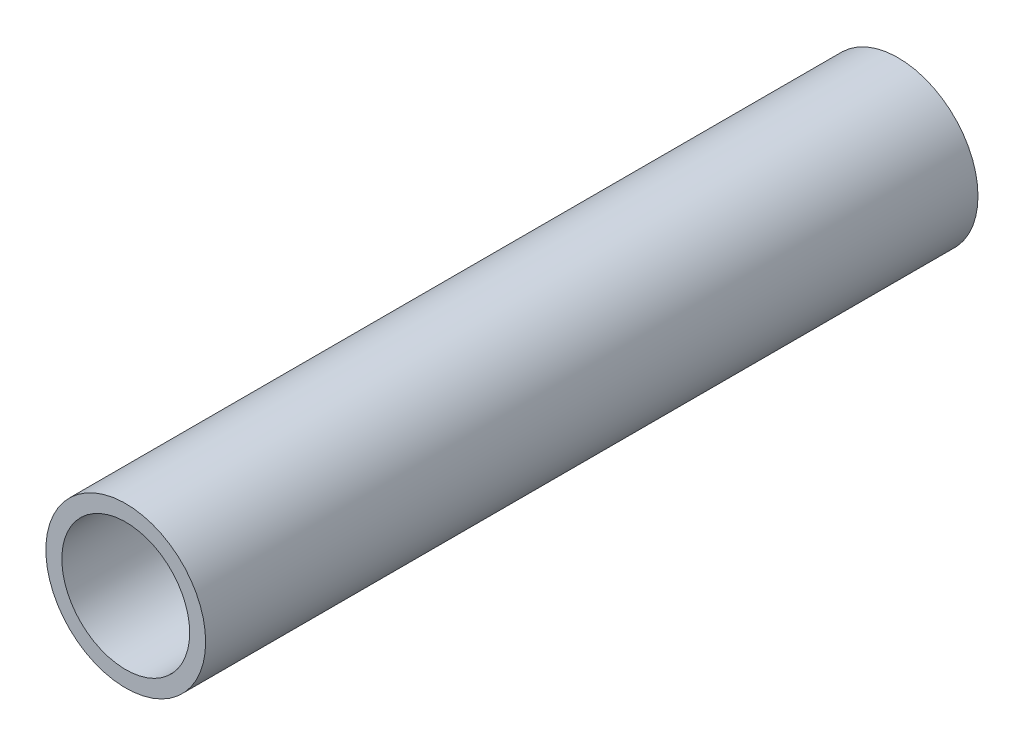
ISO-10303-21;
HEADER;
FILE_DESCRIPTION(('STEP AP214'),'2;1');
FILE_NAME('part.step','',(''),(''),'','','');
FILE_SCHEMA(('AUTOMOTIVE_DESIGN { 1 0 10303 214 1 1 1 1 }'));
ENDSEC;
DATA;
#1=APPLICATION_CONTEXT('core data for automotive mechanical design processes');
#2=APPLICATION_PROTOCOL_DEFINITION('international standard','automotive_design',2000,#1);
#3=PRODUCT_CONTEXT('',#1,'mechanical');
#4=PRODUCT('Part','Part','',(#3));
#5=PRODUCT_RELATED_PRODUCT_CATEGORY('part','',(#4));
#6=PRODUCT_DEFINITION_FORMATION('','',#4);
#7=PRODUCT_DEFINITION_CONTEXT('part definition',#1,'design');
#8=PRODUCT_DEFINITION('design','',#6,#7);
#9=PRODUCT_DEFINITION_SHAPE('','',#8);
#10=(LENGTH_UNIT() NAMED_UNIT(*) SI_UNIT(.MILLI.,.METRE.));
#11=(NAMED_UNIT(*) PLANE_ANGLE_UNIT() SI_UNIT($,.RADIAN.));
#12=(NAMED_UNIT(*) SI_UNIT($,.STERADIAN.) SOLID_ANGLE_UNIT());
#13=UNCERTAINTY_MEASURE_WITH_UNIT(LENGTH_MEASURE(1.E-05),#10,'distance_accuracy_value','');
#14=(GEOMETRIC_REPRESENTATION_CONTEXT(3) GLOBAL_UNCERTAINTY_ASSIGNED_CONTEXT((#13)) GLOBAL_UNIT_ASSIGNED_CONTEXT((#10,
#11,#12)) REPRESENTATION_CONTEXT('',''));
#15=CARTESIAN_POINT('',(0.,0.,0.));
#16=DIRECTION('',(0.,0.,1.));
#17=DIRECTION('',(1.,0.,0.));
#18=AXIS2_PLACEMENT_3D('',#15,#16,#17);
#19=CARTESIAN_POINT('',(0.,0.,184.15));
#20=DIRECTION('',(0.,0.,1.));
#21=DIRECTION('',(1.,0.,0.));
#22=AXIS2_PLACEMENT_3D('',#19,#20,#21);
#23=PLANE('',#22);
#24=CARTESIAN_POINT('',(0.,0.,184.15));
#25=DIRECTION('',(0.,0.,1.));
#26=DIRECTION('',(1.,0.,0.));
#27=AXIS2_PLACEMENT_3D('',#24,#25,#26);
#28=CIRCLE('',#27,19.05);
#29=CARTESIAN_POINT('',(19.05,0.,184.15));
#30=VERTEX_POINT('',#29);
#31=EDGE_CURVE('E10',#30,#30,#28,.T.);
#32=ORIENTED_EDGE('',*,*,#31,.T.);
#33=EDGE_LOOP('',(#32));
#34=FACE_BOUND('',#33,.T.);
#35=CARTESIAN_POINT('',(0.,0.,184.15));
#36=DIRECTION('',(0.,0.,1.));
#37=DIRECTION('',(1.,0.,0.));
#38=AXIS2_PLACEMENT_3D('',#35,#36,#37);
#39=CIRCLE('',#38,15.24);
#40=CARTESIAN_POINT('',(15.24,0.,184.15));
#41=VERTEX_POINT('',#40);
#42=EDGE_CURVE('E41',#41,#41,#39,.T.);
#43=ORIENTED_EDGE('',*,*,#42,.F.);
#44=EDGE_LOOP('',(#43));
#45=FACE_BOUND('',#44,.T.);
#46=ADVANCED_FACE('F30',(#34,#45),#23,.T.);
#47=CARTESIAN_POINT('',(0.,0.,0.));
#48=DIRECTION('',(0.,0.,1.));
#49=DIRECTION('',(1.,0.,0.));
#50=AXIS2_PLACEMENT_3D('',#47,#48,#49);
#51=PLANE('',#50);
#52=CARTESIAN_POINT('',(0.,0.,0.));
#53=DIRECTION('',(0.,0.,1.));
#54=DIRECTION('',(1.,0.,0.));
#55=AXIS2_PLACEMENT_3D('',#52,#53,#54);
#56=CIRCLE('',#55,19.05);
#57=CARTESIAN_POINT('',(19.05,0.,0.));
#58=VERTEX_POINT('',#57);
#59=EDGE_CURVE('E34',#58,#58,#56,.T.);
#60=ORIENTED_EDGE('',*,*,#59,.F.);
#61=EDGE_LOOP('',(#60));
#62=FACE_BOUND('',#61,.T.);
#63=CARTESIAN_POINT('',(0.,0.,0.));
#64=DIRECTION('',(0.,0.,1.));
#65=DIRECTION('',(1.,0.,0.));
#66=AXIS2_PLACEMENT_3D('',#63,#64,#65);
#67=CIRCLE('',#66,15.24);
#68=CARTESIAN_POINT('',(15.24,0.,0.));
#69=VERTEX_POINT('',#68);
#70=EDGE_CURVE('E43',#69,#69,#67,.T.);
#71=ORIENTED_EDGE('',*,*,#70,.T.);
#72=EDGE_LOOP('',(#71));
#73=FACE_BOUND('',#72,.T.);
#74=ADVANCED_FACE('F53',(#62,#73),#51,.F.);
#75=CARTESIAN_POINT('',(0.,0.,184.15));
#76=DIRECTION('',(0.,0.,-1.));
#77=DIRECTION('',(-1.,0.,0.));
#78=AXIS2_PLACEMENT_3D('',#75,#76,#77);
#79=CYLINDRICAL_SURFACE('',#78,19.05);
#80=ORIENTED_EDGE('',*,*,#31,.F.);
#81=EDGE_LOOP('',(#80));
#82=FACE_BOUND('',#81,.T.);
#83=ORIENTED_EDGE('',*,*,#59,.T.);
#84=EDGE_LOOP('',(#83));
#85=FACE_BOUND('',#84,.T.);
#86=ADVANCED_FACE('F32',(#82,#85),#79,.T.);
#87=CARTESIAN_POINT('',(0.,0.,184.15));
#88=DIRECTION('',(0.,0.,-1.));
#89=DIRECTION('',(-1.,0.,0.));
#90=AXIS2_PLACEMENT_3D('',#87,#88,#89);
#91=CYLINDRICAL_SURFACE('',#90,15.24);
#92=ORIENTED_EDGE('',*,*,#42,.T.);
#93=EDGE_LOOP('',(#92));
#94=FACE_BOUND('',#93,.T.);
#95=ORIENTED_EDGE('',*,*,#70,.F.);
#96=EDGE_LOOP('',(#95));
#97=FACE_BOUND('',#96,.T.);
#98=ADVANCED_FACE('F49',(#94,#97),#91,.F.);
#99=CLOSED_SHELL('',(#46,#74,#86,#98));
#100=MANIFOLD_SOLID_BREP('B2',#99);
#101=ADVANCED_BREP_SHAPE_REPRESENTATION('',(#18,#100),#14);
#102=SHAPE_DEFINITION_REPRESENTATION(#9,#101);
ENDSEC;
END-ISO-10303-21;
